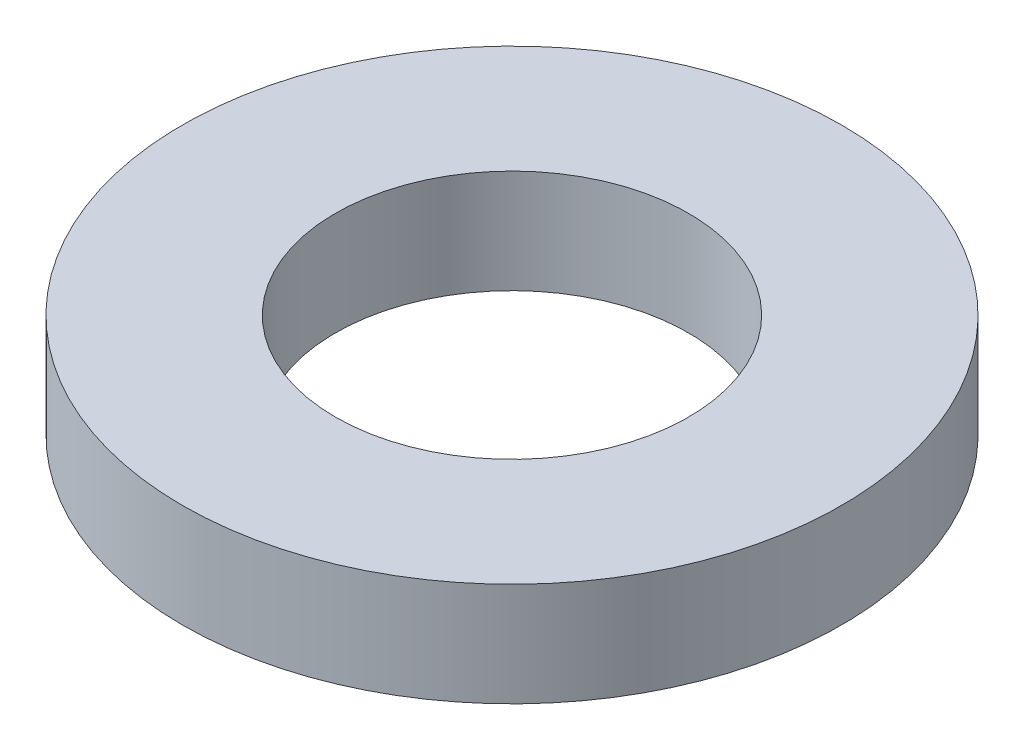
ISO-10303-21;
HEADER;
FILE_DESCRIPTION(('STEP AP214'),'2;1');
FILE_NAME('part.step','',(''),(''),'','','');
FILE_SCHEMA(('AUTOMOTIVE_DESIGN { 1 0 10303 214 1 1 1 1 }'));
ENDSEC;
DATA;
#1=APPLICATION_CONTEXT('core data for automotive mechanical design processes');
#2=APPLICATION_PROTOCOL_DEFINITION('international standard','automotive_design',2000,#1);
#3=PRODUCT_CONTEXT('',#1,'mechanical');
#4=PRODUCT('Part','Part','',(#3));
#5=PRODUCT_RELATED_PRODUCT_CATEGORY('part','',(#4));
#6=PRODUCT_DEFINITION_FORMATION('','',#4);
#7=PRODUCT_DEFINITION_CONTEXT('part definition',#1,'design');
#8=PRODUCT_DEFINITION('design','',#6,#7);
#9=PRODUCT_DEFINITION_SHAPE('','',#8);
#10=(LENGTH_UNIT() NAMED_UNIT(*) SI_UNIT(.MILLI.,.METRE.));
#11=(NAMED_UNIT(*) PLANE_ANGLE_UNIT() SI_UNIT($,.RADIAN.));
#12=(NAMED_UNIT(*) SI_UNIT($,.STERADIAN.) SOLID_ANGLE_UNIT());
#13=UNCERTAINTY_MEASURE_WITH_UNIT(LENGTH_MEASURE(1.E-05),#10,'distance_accuracy_value','');
#14=(GEOMETRIC_REPRESENTATION_CONTEXT(3) GLOBAL_UNCERTAINTY_ASSIGNED_CONTEXT((#13)) GLOBAL_UNIT_ASSIGNED_CONTEXT((#10,
#11,#12)) REPRESENTATION_CONTEXT('',''));
#15=CARTESIAN_POINT('',(0.,0.,0.));
#16=DIRECTION('',(0.,0.,1.));
#17=DIRECTION('',(1.,0.,0.));
#18=AXIS2_PLACEMENT_3D('',#15,#16,#17);
#19=CARTESIAN_POINT('',(0.,22.,0.));
#20=DIRECTION('',(0.,-1.,0.));
#21=DIRECTION('',(0.,0.,-1.));
#22=AXIS2_PLACEMENT_3D('',#19,#20,#21);
#23=CYLINDRICAL_SURFACE('',#22,70.);
#24=CARTESIAN_POINT('',(0.,22.,0.));
#25=DIRECTION('',(0.,1.,0.));
#26=DIRECTION('',(0.,0.,1.));
#27=AXIS2_PLACEMENT_3D('',#24,#25,#26);
#28=CIRCLE('',#27,70.);
#29=CARTESIAN_POINT('',(0.,22.,70.));
#30=VERTEX_POINT('',#29);
#31=EDGE_CURVE('E10',#30,#30,#28,.T.);
#32=ORIENTED_EDGE('',*,*,#31,.F.);
#33=EDGE_LOOP('',(#32));
#34=FACE_BOUND('',#33,.T.);
#35=CARTESIAN_POINT('',(0.,0.,0.));
#36=DIRECTION('',(0.,1.,0.));
#37=DIRECTION('',(0.,0.,1.));
#38=AXIS2_PLACEMENT_3D('',#35,#36,#37);
#39=CIRCLE('',#38,70.);
#40=CARTESIAN_POINT('',(0.,0.,70.));
#41=VERTEX_POINT('',#40);
#42=EDGE_CURVE('E37',#41,#41,#39,.T.);
#43=ORIENTED_EDGE('',*,*,#42,.T.);
#44=EDGE_LOOP('',(#43));
#45=FACE_BOUND('',#44,.T.);
#46=ADVANCED_FACE('F40',(#34,#45),#23,.T.);
#47=CARTESIAN_POINT('',(0.,22.,0.));
#48=DIRECTION('',(0.,1.,0.));
#49=DIRECTION('',(0.,0.,1.));
#50=AXIS2_PLACEMENT_3D('',#47,#48,#49);
#51=PLANE('',#50);
#52=CARTESIAN_POINT('',(0.,22.,0.));
#53=DIRECTION('',(0.,1.,0.));
#54=DIRECTION('',(0.,0.,1.));
#55=AXIS2_PLACEMENT_3D('',#52,#53,#54);
#56=CIRCLE('',#55,37.5);
#57=CARTESIAN_POINT('',(0.,22.,37.5));
#58=VERTEX_POINT('',#57);
#59=EDGE_CURVE('E50',#58,#58,#56,.T.);
#60=ORIENTED_EDGE('',*,*,#59,.F.);
#61=EDGE_LOOP('',(#60));
#62=FACE_BOUND('',#61,.T.);
#63=ORIENTED_EDGE('',*,*,#31,.T.);
#64=EDGE_LOOP('',(#63));
#65=FACE_BOUND('',#64,.T.);
#66=ADVANCED_FACE('F59',(#62,#65),#51,.T.);
#67=CARTESIAN_POINT('',(0.,0.,0.));
#68=DIRECTION('',(0.,1.,0.));
#69=DIRECTION('',(0.,0.,1.));
#70=AXIS2_PLACEMENT_3D('',#67,#68,#69);
#71=PLANE('',#70);
#72=CARTESIAN_POINT('',(0.,0.,0.));
#73=DIRECTION('',(0.,1.,0.));
#74=DIRECTION('',(0.,0.,1.));
#75=AXIS2_PLACEMENT_3D('',#72,#73,#74);
#76=CIRCLE('',#75,37.5);
#77=CARTESIAN_POINT('',(0.,0.,37.5));
#78=VERTEX_POINT('',#77);
#79=EDGE_CURVE('E47',#78,#78,#76,.T.);
#80=ORIENTED_EDGE('',*,*,#79,.T.);
#81=EDGE_LOOP('',(#80));
#82=FACE_BOUND('',#81,.T.);
#83=ORIENTED_EDGE('',*,*,#42,.F.);
#84=EDGE_LOOP('',(#83));
#85=FACE_BOUND('',#84,.T.);
#86=ADVANCED_FACE('F58',(#82,#85),#71,.F.);
#87=CARTESIAN_POINT('',(0.,22.,0.));
#88=DIRECTION('',(0.,-1.,0.));
#89=DIRECTION('',(0.,0.,-1.));
#90=AXIS2_PLACEMENT_3D('',#87,#88,#89);
#91=CYLINDRICAL_SURFACE('',#90,37.5);
#92=ORIENTED_EDGE('',*,*,#59,.T.);
#93=EDGE_LOOP('',(#92));
#94=FACE_BOUND('',#93,.T.);
#95=ORIENTED_EDGE('',*,*,#79,.F.);
#96=EDGE_LOOP('',(#95));
#97=FACE_BOUND('',#96,.T.);
#98=ADVANCED_FACE('F54',(#94,#97),#91,.F.);
#99=CLOSED_SHELL('',(#46,#66,#86,#98));
#100=MANIFOLD_SOLID_BREP('B2',#99);
#101=ADVANCED_BREP_SHAPE_REPRESENTATION('',(#18,#100),#14);
#102=SHAPE_DEFINITION_REPRESENTATION(#9,#101);
ENDSEC;
END-ISO-10303-21;
